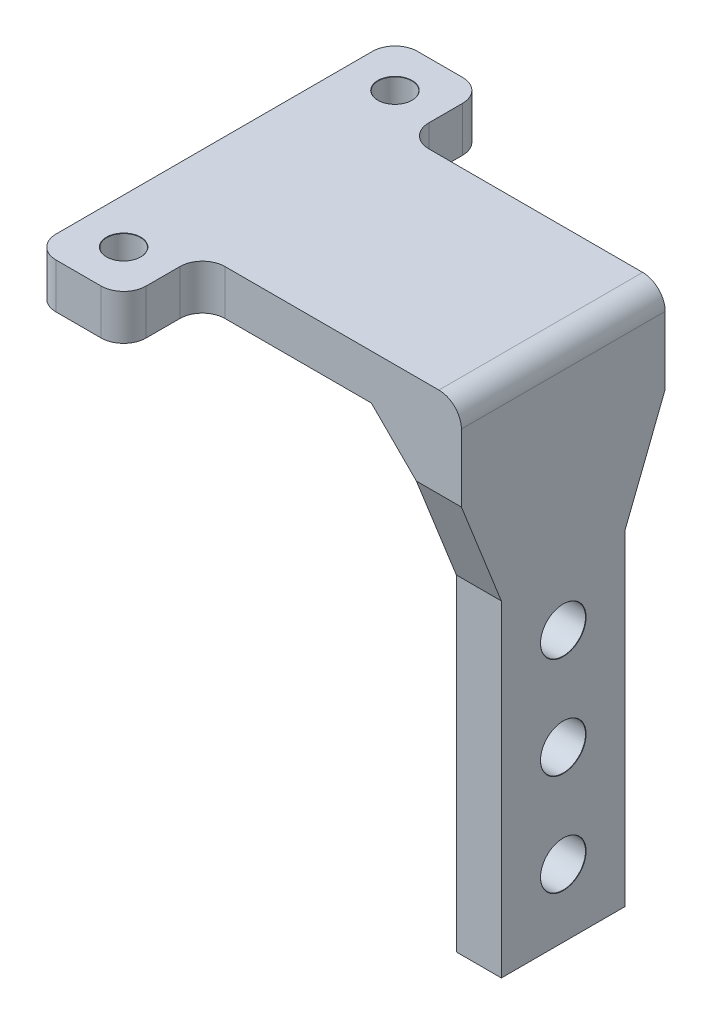
ISO-10303-21;
HEADER;
FILE_DESCRIPTION(('STEP AP214'),'2;1');
FILE_NAME('part.step','',(''),(''),'','','');
FILE_SCHEMA(('AUTOMOTIVE_DESIGN { 1 0 10303 214 1 1 1 1 }'));
ENDSEC;
DATA;
#1=APPLICATION_CONTEXT('core data for automotive mechanical design processes');
#2=APPLICATION_PROTOCOL_DEFINITION('international standard','automotive_design',2000,#1);
#3=PRODUCT_CONTEXT('',#1,'mechanical');
#4=PRODUCT('Part','Part','',(#3));
#5=PRODUCT_RELATED_PRODUCT_CATEGORY('part','',(#4));
#6=PRODUCT_DEFINITION_FORMATION('','',#4);
#7=PRODUCT_DEFINITION_CONTEXT('part definition',#1,'design');
#8=PRODUCT_DEFINITION('design','',#6,#7);
#9=PRODUCT_DEFINITION_SHAPE('','',#8);
#10=(LENGTH_UNIT() NAMED_UNIT(*) SI_UNIT(.MILLI.,.METRE.));
#11=(NAMED_UNIT(*) PLANE_ANGLE_UNIT() SI_UNIT($,.RADIAN.));
#12=(NAMED_UNIT(*) SI_UNIT($,.STERADIAN.) SOLID_ANGLE_UNIT());
#13=UNCERTAINTY_MEASURE_WITH_UNIT(LENGTH_MEASURE(1.E-05),#10,'distance_accuracy_value','');
#14=(GEOMETRIC_REPRESENTATION_CONTEXT(3) GLOBAL_UNCERTAINTY_ASSIGNED_CONTEXT((#13)) GLOBAL_UNIT_ASSIGNED_CONTEXT((#10,
#11,#12)) REPRESENTATION_CONTEXT('',''));
#15=CARTESIAN_POINT('',(0.,0.,0.));
#16=DIRECTION('',(0.,0.,1.));
#17=DIRECTION('',(1.,0.,0.));
#18=AXIS2_PLACEMENT_3D('',#15,#16,#17);
#19=CARTESIAN_POINT('',(0.,0.,0.));
#20=DIRECTION('',(0.,1.,0.));
#21=DIRECTION('',(0.,0.,1.));
#22=AXIS2_PLACEMENT_3D('',#19,#20,#21);
#23=PLANE('',#22);
#24=CARTESIAN_POINT('',(4.,0.,12.05));
#25=DIRECTION('',(0.,1.,0.));
#26=DIRECTION('',(0.,0.,1.));
#27=AXIS2_PLACEMENT_3D('',#24,#25,#26);
#28=CIRCLE('',#27,1.5);
#29=CARTESIAN_POINT('',(4.,0.,13.55));
#30=VERTEX_POINT('',#29);
#31=EDGE_CURVE('E340',#30,#30,#28,.T.);
#32=ORIENTED_EDGE('',*,*,#31,.T.);
#33=EDGE_LOOP('',(#32));
#34=FACE_BOUND('',#33,.T.);
#35=CARTESIAN_POINT('',(4.,0.,-12.05));
#36=DIRECTION('',(0.,1.,0.));
#37=DIRECTION('',(0.,0.,1.));
#38=AXIS2_PLACEMENT_3D('',#35,#36,#37);
#39=CIRCLE('',#38,1.5);
#40=CARTESIAN_POINT('',(4.,0.,-10.55));
#41=VERTEX_POINT('',#40);
#42=EDGE_CURVE('E331',#41,#41,#39,.T.);
#43=ORIENTED_EDGE('',*,*,#42,.T.);
#44=EDGE_LOOP('',(#43));
#45=FACE_BOUND('',#44,.T.);
#46=DIRECTION('',(-1.,0.,0.));
#47=VECTOR('',#46,1.);
#48=CARTESIAN_POINT('',(31.,0.,-9.05));
#49=LINE('',#48,#47);
#50=CARTESIAN_POINT('',(23.,0.,-9.05));
#51=VERTEX_POINT('',#50);
#52=CARTESIAN_POINT('',(10.,0.,-9.05));
#53=VERTEX_POINT('',#52);
#54=EDGE_CURVE('E377',#51,#53,#49,.T.);
#55=ORIENTED_EDGE('',*,*,#54,.F.);
#56=DIRECTION('',(0.,0.,1.));
#57=VECTOR('',#56,1.);
#58=CARTESIAN_POINT('',(23.,0.,9.05));
#59=LINE('',#58,#57);
#60=CARTESIAN_POINT('',(23.,0.,9.05));
#61=VERTEX_POINT('',#60);
#62=EDGE_CURVE('E276',#51,#61,#59,.T.);
#63=ORIENTED_EDGE('',*,*,#62,.T.);
#64=DIRECTION('',(1.,0.,0.));
#65=VECTOR('',#64,1.);
#66=CARTESIAN_POINT('',(8.,0.,9.05));
#67=LINE('',#66,#65);
#68=CARTESIAN_POINT('',(10.,0.,9.05));
#69=VERTEX_POINT('',#68);
#70=EDGE_CURVE('E375',#69,#61,#67,.T.);
#71=ORIENTED_EDGE('',*,*,#70,.F.);
#72=CARTESIAN_POINT('',(10.,0.,11.05));
#73=DIRECTION('',(0.,1.,0.));
#74=DIRECTION('',(0.,0.,1.));
#75=AXIS2_PLACEMENT_3D('',#72,#73,#74);
#76=CIRCLE('',#75,2.);
#77=CARTESIAN_POINT('',(8.,0.,11.05));
#78=VERTEX_POINT('',#77);
#79=EDGE_CURVE('E269',#69,#78,#76,.T.);
#80=ORIENTED_EDGE('',*,*,#79,.T.);
#81=DIRECTION('',(0.,0.,-1.));
#82=VECTOR('',#81,1.);
#83=CARTESIAN_POINT('',(8.,0.,16.05));
#84=LINE('',#83,#82);
#85=CARTESIAN_POINT('',(8.,0.,14.05));
#86=VERTEX_POINT('',#85);
#87=EDGE_CURVE('E372',#86,#78,#84,.T.);
#88=ORIENTED_EDGE('',*,*,#87,.F.);
#89=CARTESIAN_POINT('',(6.,0.,14.05));
#90=DIRECTION('',(0.,1.,0.));
#91=DIRECTION('',(0.,0.,1.));
#92=AXIS2_PLACEMENT_3D('',#89,#90,#91);
#93=CIRCLE('',#92,2.);
#94=CARTESIAN_POINT('',(6.,0.,16.05));
#95=VERTEX_POINT('',#94);
#96=EDGE_CURVE('E222',#86,#95,#93,.F.);
#97=ORIENTED_EDGE('',*,*,#96,.T.);
#98=DIRECTION('',(1.,0.,0.));
#99=VECTOR('',#98,1.);
#100=CARTESIAN_POINT('',(0.,0.,16.05));
#101=LINE('',#100,#99);
#102=CARTESIAN_POINT('',(2.,0.,16.05));
#103=VERTEX_POINT('',#102);
#104=EDGE_CURVE('E369',#103,#95,#101,.T.);
#105=ORIENTED_EDGE('',*,*,#104,.F.);
#106=CARTESIAN_POINT('',(2.,0.,14.05));
#107=DIRECTION('',(0.,1.,0.));
#108=DIRECTION('',(0.,0.,1.));
#109=AXIS2_PLACEMENT_3D('',#106,#107,#108);
#110=CIRCLE('',#109,2.);
#111=CARTESIAN_POINT('',(0.,0.,14.05));
#112=VERTEX_POINT('',#111);
#113=EDGE_CURVE('E224',#103,#112,#110,.F.);
#114=ORIENTED_EDGE('',*,*,#113,.T.);
#115=DIRECTION('',(0.,0.,1.));
#116=VECTOR('',#115,1.);
#117=CARTESIAN_POINT('',(0.,0.,-16.05));
#118=LINE('',#117,#116);
#119=CARTESIAN_POINT('',(0.,0.,-14.05));
#120=VERTEX_POINT('',#119);
#121=EDGE_CURVE('E366',#120,#112,#118,.T.);
#122=ORIENTED_EDGE('',*,*,#121,.F.);
#123=CARTESIAN_POINT('',(2.,0.,-14.05));
#124=DIRECTION('',(0.,1.,0.));
#125=DIRECTION('',(0.,0.,1.));
#126=AXIS2_PLACEMENT_3D('',#123,#124,#125);
#127=CIRCLE('',#126,2.);
#128=CARTESIAN_POINT('',(2.,0.,-16.05));
#129=VERTEX_POINT('',#128);
#130=EDGE_CURVE('E228',#120,#129,#127,.F.);
#131=ORIENTED_EDGE('',*,*,#130,.T.);
#132=DIRECTION('',(-1.,0.,0.));
#133=VECTOR('',#132,1.);
#134=CARTESIAN_POINT('',(8.,0.,-16.05));
#135=LINE('',#134,#133);
#136=CARTESIAN_POINT('',(6.,0.,-16.05));
#137=VERTEX_POINT('',#136);
#138=EDGE_CURVE('E343',#137,#129,#135,.T.);
#139=ORIENTED_EDGE('',*,*,#138,.F.);
#140=CARTESIAN_POINT('',(6.,0.,-14.05));
#141=DIRECTION('',(0.,1.,0.));
#142=DIRECTION('',(0.,0.,1.));
#143=AXIS2_PLACEMENT_3D('',#140,#141,#142);
#144=CIRCLE('',#143,2.);
#145=CARTESIAN_POINT('',(8.,0.,-14.05));
#146=VERTEX_POINT('',#145);
#147=EDGE_CURVE('E226',#137,#146,#144,.F.);
#148=ORIENTED_EDGE('',*,*,#147,.T.);
#149=DIRECTION('',(0.,0.,-1.));
#150=VECTOR('',#149,1.);
#151=CARTESIAN_POINT('',(8.,0.,-9.05));
#152=LINE('',#151,#150);
#153=CARTESIAN_POINT('',(8.,0.,-11.05));
#154=VERTEX_POINT('',#153);
#155=EDGE_CURVE('E348',#154,#146,#152,.T.);
#156=ORIENTED_EDGE('',*,*,#155,.F.);
#157=CARTESIAN_POINT('',(10.,0.,-11.05));
#158=DIRECTION('',(0.,1.,0.));
#159=DIRECTION('',(0.,0.,1.));
#160=AXIS2_PLACEMENT_3D('',#157,#158,#159);
#161=CIRCLE('',#160,2.);
#162=EDGE_CURVE('E264',#154,#53,#161,.T.);
#163=ORIENTED_EDGE('',*,*,#162,.T.);
#164=EDGE_LOOP('',(#55,#63,#71,#80,#88,#97,#105,#114,#122,#131,#139,#148,#156,#163));
#165=FACE_BOUND('',#164,.T.);
#166=ADVANCED_FACE('F39',(#34,#45,#165),#23,.F.);
#167=CARTESIAN_POINT('',(8.,4.,-16.05));
#168=DIRECTION('',(0.,0.,1.));
#169=DIRECTION('',(1.,0.,0.));
#170=AXIS2_PLACEMENT_3D('',#167,#168,#169);
#171=PLANE('',#170);
#172=ORIENTED_EDGE('',*,*,#138,.T.);
#173=DIRECTION('',(0.,-1.,0.));
#174=VECTOR('',#173,1.);
#175=CARTESIAN_POINT('',(2.,4.,-16.05));
#176=LINE('',#175,#174);
#177=CARTESIAN_POINT('',(2.,4.,-16.05));
#178=VERTEX_POINT('',#177);
#179=EDGE_CURVE('E233',#129,#178,#176,.F.);
#180=ORIENTED_EDGE('',*,*,#179,.T.);
#181=DIRECTION('',(-1.,0.,0.));
#182=VECTOR('',#181,1.);
#183=CARTESIAN_POINT('',(8.,4.,-16.05));
#184=LINE('',#183,#182);
#185=CARTESIAN_POINT('',(6.,4.,-16.05));
#186=VERTEX_POINT('',#185);
#187=EDGE_CURVE('E344',#186,#178,#184,.T.);
#188=ORIENTED_EDGE('',*,*,#187,.F.);
#189=DIRECTION('',(0.,-1.,0.));
#190=VECTOR('',#189,1.);
#191=CARTESIAN_POINT('',(6.,4.,-16.05));
#192=LINE('',#191,#190);
#193=EDGE_CURVE('E230',#186,#137,#192,.T.);
#194=ORIENTED_EDGE('',*,*,#193,.T.);
#195=EDGE_LOOP('',(#172,#180,#188,#194));
#196=FACE_BOUND('',#195,.T.);
#197=ADVANCED_FACE('F395',(#196),#171,.F.);
#198=CARTESIAN_POINT('',(0.,4.,-16.05));
#199=DIRECTION('',(1.,0.,0.));
#200=DIRECTION('',(0.,0.,-1.));
#201=AXIS2_PLACEMENT_3D('',#198,#199,#200);
#202=PLANE('',#201);
#203=DIRECTION('',(0.,0.,1.));
#204=VECTOR('',#203,1.);
#205=CARTESIAN_POINT('',(0.,4.,-16.05));
#206=LINE('',#205,#204);
#207=CARTESIAN_POINT('',(0.,4.,-14.05));
#208=VERTEX_POINT('',#207);
#209=CARTESIAN_POINT('',(0.,4.,14.05));
#210=VERTEX_POINT('',#209);
#211=EDGE_CURVE('E347',#208,#210,#206,.T.);
#212=ORIENTED_EDGE('',*,*,#211,.F.);
#213=DIRECTION('',(0.,-1.,0.));
#214=VECTOR('',#213,1.);
#215=CARTESIAN_POINT('',(0.,4.,-14.05));
#216=LINE('',#215,#214);
#217=EDGE_CURVE('E213',#208,#120,#216,.T.);
#218=ORIENTED_EDGE('',*,*,#217,.T.);
#219=ORIENTED_EDGE('',*,*,#121,.T.);
#220=DIRECTION('',(0.,-1.,0.));
#221=VECTOR('',#220,1.);
#222=CARTESIAN_POINT('',(0.,4.,14.05));
#223=LINE('',#222,#221);
#224=EDGE_CURVE('E210',#112,#210,#223,.F.);
#225=ORIENTED_EDGE('',*,*,#224,.T.);
#226=EDGE_LOOP('',(#212,#218,#219,#225));
#227=FACE_BOUND('',#226,.T.);
#228=ADVANCED_FACE('F404',(#227),#202,.F.);
#229=CARTESIAN_POINT('',(0.,4.,16.05));
#230=DIRECTION('',(0.,0.,-1.));
#231=DIRECTION('',(-1.,0.,0.));
#232=AXIS2_PLACEMENT_3D('',#229,#230,#231);
#233=PLANE('',#232);
#234=DIRECTION('',(1.,0.,0.));
#235=VECTOR('',#234,1.);
#236=CARTESIAN_POINT('',(0.,4.,16.05));
#237=LINE('',#236,#235);
#238=CARTESIAN_POINT('',(2.,4.,16.05));
#239=VERTEX_POINT('',#238);
#240=CARTESIAN_POINT('',(6.,4.,16.05));
#241=VERTEX_POINT('',#240);
#242=EDGE_CURVE('E351',#239,#241,#237,.T.);
#243=ORIENTED_EDGE('',*,*,#242,.F.);
#244=DIRECTION('',(0.,-1.,0.));
#245=VECTOR('',#244,1.);
#246=CARTESIAN_POINT('',(2.,4.,16.05));
#247=LINE('',#246,#245);
#248=EDGE_CURVE('E253',#239,#103,#247,.T.);
#249=ORIENTED_EDGE('',*,*,#248,.T.);
#250=ORIENTED_EDGE('',*,*,#104,.T.);
#251=DIRECTION('',(0.,-1.,0.));
#252=VECTOR('',#251,1.);
#253=CARTESIAN_POINT('',(6.,4.,16.05));
#254=LINE('',#253,#252);
#255=EDGE_CURVE('E251',#95,#241,#254,.F.);
#256=ORIENTED_EDGE('',*,*,#255,.T.);
#257=EDGE_LOOP('',(#243,#249,#250,#256));
#258=FACE_BOUND('',#257,.T.);
#259=ADVANCED_FACE('F413',(#258),#233,.F.);
#260=CARTESIAN_POINT('',(8.,4.,16.05));
#261=DIRECTION('',(-1.,0.,0.));
#262=DIRECTION('',(0.,0.,1.));
#263=AXIS2_PLACEMENT_3D('',#260,#261,#262);
#264=PLANE('',#263);
#265=DIRECTION('',(0.,0.,-1.));
#266=VECTOR('',#265,1.);
#267=CARTESIAN_POINT('',(8.,4.,16.05));
#268=LINE('',#267,#266);
#269=CARTESIAN_POINT('',(8.,4.,14.05));
#270=VERTEX_POINT('',#269);
#271=CARTESIAN_POINT('',(8.,4.,11.05));
#272=VERTEX_POINT('',#271);
#273=EDGE_CURVE('E354',#270,#272,#268,.T.);
#274=ORIENTED_EDGE('',*,*,#273,.F.);
#275=DIRECTION('',(0.,-1.,0.));
#276=VECTOR('',#275,1.);
#277=CARTESIAN_POINT('',(8.,4.,14.05));
#278=LINE('',#277,#276);
#279=EDGE_CURVE('E258',#270,#86,#278,.T.);
#280=ORIENTED_EDGE('',*,*,#279,.T.);
#281=ORIENTED_EDGE('',*,*,#87,.T.);
#282=DIRECTION('',(0.,-1.,0.));
#283=VECTOR('',#282,1.);
#284=CARTESIAN_POINT('',(8.,4.,11.05));
#285=LINE('',#284,#283);
#286=EDGE_CURVE('E256',#78,#272,#285,.F.);
#287=ORIENTED_EDGE('',*,*,#286,.T.);
#288=EDGE_LOOP('',(#274,#280,#281,#287));
#289=FACE_BOUND('',#288,.T.);
#290=ADVANCED_FACE('F422',(#289),#264,.F.);
#291=CARTESIAN_POINT('',(8.,4.,9.05));
#292=DIRECTION('',(0.,0.,-1.));
#293=DIRECTION('',(-1.,0.,0.));
#294=AXIS2_PLACEMENT_3D('',#291,#292,#293);
#295=PLANE('',#294);
#296=DIRECTION('',(-0.707106781186544,0.707106781186551,0.));
#297=VECTOR('',#296,1.);
#298=CARTESIAN_POINT('',(13.5000000000001,9.50000000000002,9.05));
#299=LINE('',#298,#297);
#300=CARTESIAN_POINT('',(27.,-4.00000000000005,9.05));
#301=VERTEX_POINT('',#300);
#302=EDGE_CURVE('E203',#61,#301,#299,.F.);
#303=ORIENTED_EDGE('',*,*,#302,.T.);
#304=DIRECTION('',(-1.,0.,0.));
#305=VECTOR('',#304,1.);
#306=CARTESIAN_POINT('',(31.,-4.00000000000005,9.05));
#307=LINE('',#306,#305);
#308=CARTESIAN_POINT('',(31.,-4.00000000000005,9.05));
#309=VERTEX_POINT('',#308);
#310=EDGE_CURVE('E186',#309,#301,#307,.T.);
#311=ORIENTED_EDGE('',*,*,#310,.F.);
#312=DIRECTION('',(0.,-1.,0.));
#313=VECTOR('',#312,1.);
#314=CARTESIAN_POINT('',(31.,4.,9.05));
#315=LINE('',#314,#313);
#316=CARTESIAN_POINT('',(31.,2.,9.05));
#317=VERTEX_POINT('',#316);
#318=EDGE_CURVE('E199',#317,#309,#315,.T.);
#319=ORIENTED_EDGE('',*,*,#318,.F.);
#320=CARTESIAN_POINT('',(29.,2.,9.05));
#321=DIRECTION('',(0.,0.,-1.));
#322=DIRECTION('',(-1.,0.,0.));
#323=AXIS2_PLACEMENT_3D('',#320,#321,#322);
#324=CIRCLE('',#323,2.);
#325=CARTESIAN_POINT('',(29.,4.,9.05));
#326=VERTEX_POINT('',#325);
#327=EDGE_CURVE('E47',#317,#326,#324,.F.);
#328=ORIENTED_EDGE('',*,*,#327,.T.);
#329=DIRECTION('',(1.,0.,0.));
#330=VECTOR('',#329,1.);
#331=CARTESIAN_POINT('',(8.,4.,9.05));
#332=LINE('',#331,#330);
#333=CARTESIAN_POINT('',(10.,4.,9.05));
#334=VERTEX_POINT('',#333);
#335=EDGE_CURVE('E357',#334,#326,#332,.T.);
#336=ORIENTED_EDGE('',*,*,#335,.F.);
#337=DIRECTION('',(0.,-1.,0.));
#338=VECTOR('',#337,1.);
#339=CARTESIAN_POINT('',(10.,0.,9.05));
#340=LINE('',#339,#338);
#341=EDGE_CURVE('E261',#334,#69,#340,.T.);
#342=ORIENTED_EDGE('',*,*,#341,.T.);
#343=ORIENTED_EDGE('',*,*,#70,.T.);
#344=EDGE_LOOP('',(#303,#311,#319,#328,#336,#342,#343));
#345=FACE_BOUND('',#344,.T.);
#346=ADVANCED_FACE('F198',(#345),#295,.F.);
#347=CARTESIAN_POINT('',(31.,4.,9.05));
#348=DIRECTION('',(-1.,0.,0.));
#349=DIRECTION('',(0.,0.,1.));
#350=AXIS2_PLACEMENT_3D('',#347,#348,#349);
#351=PLANE('',#350);
#352=CARTESIAN_POINT('',(31.,-36.,0.));
#353=DIRECTION('',(1.,0.,0.));
#354=DIRECTION('',(0.,0.,-1.));
#355=AXIS2_PLACEMENT_3D('',#352,#353,#354);
#356=CIRCLE('',#355,2.025);
#357=CARTESIAN_POINT('',(31.,-36.,-2.025));
#358=VERTEX_POINT('',#357);
#359=EDGE_CURVE('E306',#358,#358,#356,.T.);
#360=ORIENTED_EDGE('',*,*,#359,.F.);
#361=EDGE_LOOP('',(#360));
#362=FACE_BOUND('',#361,.T.);
#363=CARTESIAN_POINT('',(31.,-27.,0.));
#364=DIRECTION('',(1.,0.,0.));
#365=DIRECTION('',(0.,0.,-1.));
#366=AXIS2_PLACEMENT_3D('',#363,#364,#365);
#367=CIRCLE('',#366,2.025);
#368=CARTESIAN_POINT('',(31.,-27.,-2.025));
#369=VERTEX_POINT('',#368);
#370=EDGE_CURVE('E299',#369,#369,#367,.T.);
#371=ORIENTED_EDGE('',*,*,#370,.F.);
#372=EDGE_LOOP('',(#371));
#373=FACE_BOUND('',#372,.T.);
#374=CARTESIAN_POINT('',(31.,-18.,0.));
#375=DIRECTION('',(1.,0.,0.));
#376=DIRECTION('',(0.,0.,-1.));
#377=AXIS2_PLACEMENT_3D('',#374,#375,#376);
#378=CIRCLE('',#377,2.025);
#379=CARTESIAN_POINT('',(31.,-18.,-2.025));
#380=VERTEX_POINT('',#379);
#381=EDGE_CURVE('E295',#380,#380,#378,.T.);
#382=ORIENTED_EDGE('',*,*,#381,.F.);
#383=EDGE_LOOP('',(#382));
#384=FACE_BOUND('',#383,.T.);
#385=DIRECTION('',(0.,-0.930248086317103,-0.366931189602858));
#386=VECTOR('',#385,1.);
#387=CARTESIAN_POINT('',(31.,-4.00000000000005,9.05));
#388=LINE('',#387,#386);
#389=CARTESIAN_POINT('',(31.,-13.,5.5));
#390=VERTEX_POINT('',#389);
#391=EDGE_CURVE('E182',#309,#390,#388,.T.);
#392=ORIENTED_EDGE('',*,*,#391,.T.);
#393=DIRECTION('',(0.,-1.,0.));
#394=VECTOR('',#393,1.);
#395=CARTESIAN_POINT('',(31.,-13.,5.5));
#396=LINE('',#395,#394);
#397=CARTESIAN_POINT('',(31.,-42.,5.5));
#398=VERTEX_POINT('',#397);
#399=EDGE_CURVE('E193',#390,#398,#396,.T.);
#400=ORIENTED_EDGE('',*,*,#399,.T.);
#401=DIRECTION('',(0.,0.,1.));
#402=VECTOR('',#401,1.);
#403=CARTESIAN_POINT('',(31.,-42.,9.05));
#404=LINE('',#403,#402);
#405=CARTESIAN_POINT('',(31.,-42.,-5.50000000000002));
#406=VERTEX_POINT('',#405);
#407=EDGE_CURVE('E291',#406,#398,#404,.T.);
#408=ORIENTED_EDGE('',*,*,#407,.F.);
#409=DIRECTION('',(0.,1.,0.));
#410=VECTOR('',#409,1.);
#411=CARTESIAN_POINT('',(31.,-13.,-5.50000000000002));
#412=LINE('',#411,#410);
#413=CARTESIAN_POINT('',(31.,-13.,-5.50000000000002));
#414=VERTEX_POINT('',#413);
#415=EDGE_CURVE('E62',#406,#414,#412,.T.);
#416=ORIENTED_EDGE('',*,*,#415,.T.);
#417=DIRECTION('',(0.,0.930248086317103,-0.366931189602856));
#418=VECTOR('',#417,1.);
#419=CARTESIAN_POINT('',(31.,-4.00000000000005,-9.05));
#420=LINE('',#419,#418);
#421=CARTESIAN_POINT('',(31.,-4.00000000000005,-9.05));
#422=VERTEX_POINT('',#421);
#423=EDGE_CURVE('E457',#414,#422,#420,.T.);
#424=ORIENTED_EDGE('',*,*,#423,.T.);
#425=DIRECTION('',(0.,-1.,0.));
#426=VECTOR('',#425,1.);
#427=CARTESIAN_POINT('',(31.,4.,-9.05));
#428=LINE('',#427,#426);
#429=CARTESIAN_POINT('',(31.,2.,-9.05));
#430=VERTEX_POINT('',#429);
#431=EDGE_CURVE('E211',#430,#422,#428,.T.);
#432=ORIENTED_EDGE('',*,*,#431,.F.);
#433=DIRECTION('',(0.,0.,-1.));
#434=VECTOR('',#433,1.);
#435=CARTESIAN_POINT('',(31.,2.,9.05));
#436=LINE('',#435,#434);
#437=EDGE_CURVE('E209',#430,#317,#436,.F.);
#438=ORIENTED_EDGE('',*,*,#437,.T.);
#439=ORIENTED_EDGE('',*,*,#318,.T.);
#440=EDGE_LOOP('',(#392,#400,#408,#416,#424,#432,#438,#439));
#441=FACE_BOUND('',#440,.T.);
#442=ADVANCED_FACE('F206',(#362,#373,#384,#441),#351,.F.);
#443=CARTESIAN_POINT('',(31.,4.,-9.05));
#444=DIRECTION('',(0.,0.,1.));
#445=DIRECTION('',(1.,0.,0.));
#446=AXIS2_PLACEMENT_3D('',#443,#444,#445);
#447=PLANE('',#446);
#448=ORIENTED_EDGE('',*,*,#431,.T.);
#449=DIRECTION('',(-1.,0.,0.));
#450=VECTOR('',#449,1.);
#451=CARTESIAN_POINT('',(31.,-4.00000000000005,-9.05));
#452=LINE('',#451,#450);
#453=CARTESIAN_POINT('',(27.,-4.00000000000005,-9.05));
#454=VERTEX_POINT('',#453);
#455=EDGE_CURVE('E461',#422,#454,#452,.T.);
#456=ORIENTED_EDGE('',*,*,#455,.T.);
#457=DIRECTION('',(0.707106781186544,-0.707106781186551,0.));
#458=VECTOR('',#457,1.);
#459=CARTESIAN_POINT('',(25.,-1.99999999999998,-9.05));
#460=LINE('',#459,#458);
#461=EDGE_CURVE('E278',#454,#51,#460,.F.);
#462=ORIENTED_EDGE('',*,*,#461,.T.);
#463=ORIENTED_EDGE('',*,*,#54,.T.);
#464=DIRECTION('',(0.,-1.,0.));
#465=VECTOR('',#464,1.);
#466=CARTESIAN_POINT('',(10.,4.,-9.05));
#467=LINE('',#466,#465);
#468=CARTESIAN_POINT('',(10.,4.,-9.05));
#469=VERTEX_POINT('',#468);
#470=EDGE_CURVE('E248',#53,#469,#467,.F.);
#471=ORIENTED_EDGE('',*,*,#470,.T.);
#472=DIRECTION('',(-1.,0.,0.));
#473=VECTOR('',#472,1.);
#474=CARTESIAN_POINT('',(31.,4.,-9.05));
#475=LINE('',#474,#473);
#476=CARTESIAN_POINT('',(29.,4.,-9.05));
#477=VERTEX_POINT('',#476);
#478=EDGE_CURVE('E360',#477,#469,#475,.T.);
#479=ORIENTED_EDGE('',*,*,#478,.F.);
#480=CARTESIAN_POINT('',(29.,2.,-9.05));
#481=DIRECTION('',(0.,0.,1.));
#482=DIRECTION('',(1.,0.,0.));
#483=AXIS2_PLACEMENT_3D('',#480,#481,#482);
#484=CIRCLE('',#483,2.);
#485=EDGE_CURVE('E284',#477,#430,#484,.F.);
#486=ORIENTED_EDGE('',*,*,#485,.T.);
#487=EDGE_LOOP('',(#448,#456,#462,#463,#471,#479,#486));
#488=FACE_BOUND('',#487,.T.);
#489=ADVANCED_FACE('F434',(#488),#447,.F.);
#490=CARTESIAN_POINT('',(8.,4.,-9.05));
#491=DIRECTION('',(-1.,0.,0.));
#492=DIRECTION('',(0.,0.,1.));
#493=AXIS2_PLACEMENT_3D('',#490,#491,#492);
#494=PLANE('',#493);
#495=DIRECTION('',(0.,0.,-1.));
#496=VECTOR('',#495,1.);
#497=CARTESIAN_POINT('',(8.,4.,-9.05));
#498=LINE('',#497,#496);
#499=CARTESIAN_POINT('',(8.,4.,-11.05));
#500=VERTEX_POINT('',#499);
#501=CARTESIAN_POINT('',(8.,4.,-14.05));
#502=VERTEX_POINT('',#501);
#503=EDGE_CURVE('E216',#500,#502,#498,.T.);
#504=ORIENTED_EDGE('',*,*,#503,.F.);
#505=DIRECTION('',(0.,-1.,0.));
#506=VECTOR('',#505,1.);
#507=CARTESIAN_POINT('',(8.,0.,-11.05));
#508=LINE('',#507,#506);
#509=EDGE_CURVE('E245',#500,#154,#508,.T.);
#510=ORIENTED_EDGE('',*,*,#509,.T.);
#511=ORIENTED_EDGE('',*,*,#155,.T.);
#512=DIRECTION('',(0.,-1.,0.));
#513=VECTOR('',#512,1.);
#514=CARTESIAN_POINT('',(8.,4.,-14.05));
#515=LINE('',#514,#513);
#516=EDGE_CURVE('E243',#146,#502,#515,.F.);
#517=ORIENTED_EDGE('',*,*,#516,.T.);
#518=EDGE_LOOP('',(#504,#510,#511,#517));
#519=FACE_BOUND('',#518,.T.);
#520=ADVANCED_FACE('F383',(#519),#494,.F.);
#521=CARTESIAN_POINT('',(0.,4.,0.));
#522=DIRECTION('',(0.,1.,0.));
#523=DIRECTION('',(0.,0.,1.));
#524=AXIS2_PLACEMENT_3D('',#521,#522,#523);
#525=PLANE('',#524);
#526=CARTESIAN_POINT('',(4.,4.,-12.05));
#527=DIRECTION('',(0.,1.,0.));
#528=DIRECTION('',(0.,0.,1.));
#529=AXIS2_PLACEMENT_3D('',#526,#527,#528);
#530=CIRCLE('',#529,1.525);
#531=CARTESIAN_POINT('',(4.,4.,-10.525));
#532=VERTEX_POINT('',#531);
#533=EDGE_CURVE('E325',#532,#532,#530,.T.);
#534=ORIENTED_EDGE('',*,*,#533,.F.);
#535=EDGE_LOOP('',(#534));
#536=FACE_BOUND('',#535,.T.);
#537=CARTESIAN_POINT('',(4.,4.,12.05));
#538=DIRECTION('',(0.,1.,0.));
#539=DIRECTION('',(0.,0.,1.));
#540=AXIS2_PLACEMENT_3D('',#537,#538,#539);
#541=CIRCLE('',#540,1.525);
#542=CARTESIAN_POINT('',(4.,4.,13.575));
#543=VERTEX_POINT('',#542);
#544=EDGE_CURVE('E334',#543,#543,#541,.T.);
#545=ORIENTED_EDGE('',*,*,#544,.F.);
#546=EDGE_LOOP('',(#545));
#547=FACE_BOUND('',#546,.T.);
#548=ORIENTED_EDGE('',*,*,#335,.T.);
#549=DIRECTION('',(0.,0.,-1.));
#550=VECTOR('',#549,1.);
#551=CARTESIAN_POINT('',(29.,4.,-9.05));
#552=LINE('',#551,#550);
#553=EDGE_CURVE('E281',#326,#477,#552,.T.);
#554=ORIENTED_EDGE('',*,*,#553,.T.);
#555=ORIENTED_EDGE('',*,*,#478,.T.);
#556=CARTESIAN_POINT('',(10.,4.,-11.05));
#557=DIRECTION('',(0.,1.,0.));
#558=DIRECTION('',(0.,0.,1.));
#559=AXIS2_PLACEMENT_3D('',#556,#557,#558);
#560=CIRCLE('',#559,2.);
#561=EDGE_CURVE('E267',#469,#500,#560,.F.);
#562=ORIENTED_EDGE('',*,*,#561,.T.);
#563=ORIENTED_EDGE('',*,*,#503,.T.);
#564=CARTESIAN_POINT('',(6.,4.,-14.05));
#565=DIRECTION('',(0.,1.,0.));
#566=DIRECTION('',(0.,0.,1.));
#567=AXIS2_PLACEMENT_3D('',#564,#565,#566);
#568=CIRCLE('',#567,2.);
#569=EDGE_CURVE('E239',#502,#186,#568,.T.);
#570=ORIENTED_EDGE('',*,*,#569,.T.);
#571=ORIENTED_EDGE('',*,*,#187,.T.);
#572=CARTESIAN_POINT('',(2.,4.,-14.05));
#573=DIRECTION('',(0.,1.,0.));
#574=DIRECTION('',(0.,0.,1.));
#575=AXIS2_PLACEMENT_3D('',#572,#573,#574);
#576=CIRCLE('',#575,2.);
#577=EDGE_CURVE('E241',#178,#208,#576,.T.);
#578=ORIENTED_EDGE('',*,*,#577,.T.);
#579=ORIENTED_EDGE('',*,*,#211,.T.);
#580=CARTESIAN_POINT('',(2.,4.,14.05));
#581=DIRECTION('',(0.,1.,0.));
#582=DIRECTION('',(0.,0.,1.));
#583=AXIS2_PLACEMENT_3D('',#580,#581,#582);
#584=CIRCLE('',#583,2.);
#585=EDGE_CURVE('E237',#210,#239,#584,.T.);
#586=ORIENTED_EDGE('',*,*,#585,.T.);
#587=ORIENTED_EDGE('',*,*,#242,.T.);
#588=CARTESIAN_POINT('',(6.,4.,14.05));
#589=DIRECTION('',(0.,1.,0.));
#590=DIRECTION('',(0.,0.,1.));
#591=AXIS2_PLACEMENT_3D('',#588,#589,#590);
#592=CIRCLE('',#591,2.);
#593=EDGE_CURVE('E235',#241,#270,#592,.T.);
#594=ORIENTED_EDGE('',*,*,#593,.T.);
#595=ORIENTED_EDGE('',*,*,#273,.T.);
#596=CARTESIAN_POINT('',(10.,4.,11.05));
#597=DIRECTION('',(0.,1.,0.));
#598=DIRECTION('',(0.,0.,1.));
#599=AXIS2_PLACEMENT_3D('',#596,#597,#598);
#600=CIRCLE('',#599,2.);
#601=EDGE_CURVE('E271',#272,#334,#600,.F.);
#602=ORIENTED_EDGE('',*,*,#601,.T.);
#603=EDGE_LOOP('',(#548,#554,#555,#562,#563,#570,#571,#578,#579,#586,#587,#594,#595,#602));
#604=FACE_BOUND('',#603,.T.);
#605=ADVANCED_FACE('F392',(#536,#547,#604),#525,.T.);
#606=CARTESIAN_POINT('',(2.,4.,-14.05));
#607=DIRECTION('',(0.,-1.,0.));
#608=DIRECTION('',(0.,0.,-1.));
#609=AXIS2_PLACEMENT_3D('',#606,#607,#608);
#610=CYLINDRICAL_SURFACE('',#609,2.);
#611=ORIENTED_EDGE('',*,*,#577,.F.);
#612=ORIENTED_EDGE('',*,*,#179,.F.);
#613=ORIENTED_EDGE('',*,*,#130,.F.);
#614=ORIENTED_EDGE('',*,*,#217,.F.);
#615=EDGE_LOOP('',(#611,#612,#613,#614));
#616=FACE_BOUND('',#615,.T.);
#617=ADVANCED_FACE('F399',(#616),#610,.T.);
#618=CARTESIAN_POINT('',(10.,4.,-11.05));
#619=DIRECTION('',(0.,1.,0.));
#620=DIRECTION('',(0.,0.,1.));
#621=AXIS2_PLACEMENT_3D('',#618,#619,#620);
#622=CYLINDRICAL_SURFACE('',#621,2.);
#623=ORIENTED_EDGE('',*,*,#561,.F.);
#624=ORIENTED_EDGE('',*,*,#470,.F.);
#625=ORIENTED_EDGE('',*,*,#162,.F.);
#626=ORIENTED_EDGE('',*,*,#509,.F.);
#627=EDGE_LOOP('',(#623,#624,#625,#626));
#628=FACE_BOUND('',#627,.T.);
#629=ADVANCED_FACE('F439',(#628),#622,.F.);
#630=CARTESIAN_POINT('',(6.,4.,-14.05));
#631=DIRECTION('',(0.,-1.,0.));
#632=DIRECTION('',(0.,0.,-1.));
#633=AXIS2_PLACEMENT_3D('',#630,#631,#632);
#634=CYLINDRICAL_SURFACE('',#633,2.);
#635=ORIENTED_EDGE('',*,*,#569,.F.);
#636=ORIENTED_EDGE('',*,*,#516,.F.);
#637=ORIENTED_EDGE('',*,*,#147,.F.);
#638=ORIENTED_EDGE('',*,*,#193,.F.);
#639=EDGE_LOOP('',(#635,#636,#637,#638));
#640=FACE_BOUND('',#639,.T.);
#641=ADVANCED_FACE('F388',(#640),#634,.T.);
#642=CARTESIAN_POINT('',(2.,4.,14.05));
#643=DIRECTION('',(0.,-1.,0.));
#644=DIRECTION('',(0.,0.,-1.));
#645=AXIS2_PLACEMENT_3D('',#642,#643,#644);
#646=CYLINDRICAL_SURFACE('',#645,2.);
#647=ORIENTED_EDGE('',*,*,#585,.F.);
#648=ORIENTED_EDGE('',*,*,#224,.F.);
#649=ORIENTED_EDGE('',*,*,#113,.F.);
#650=ORIENTED_EDGE('',*,*,#248,.F.);
#651=EDGE_LOOP('',(#647,#648,#649,#650));
#652=FACE_BOUND('',#651,.T.);
#653=ADVANCED_FACE('F408',(#652),#646,.T.);
#654=CARTESIAN_POINT('',(6.,4.,14.05));
#655=DIRECTION('',(0.,-1.,0.));
#656=DIRECTION('',(0.,0.,-1.));
#657=AXIS2_PLACEMENT_3D('',#654,#655,#656);
#658=CYLINDRICAL_SURFACE('',#657,2.);
#659=ORIENTED_EDGE('',*,*,#593,.F.);
#660=ORIENTED_EDGE('',*,*,#255,.F.);
#661=ORIENTED_EDGE('',*,*,#96,.F.);
#662=ORIENTED_EDGE('',*,*,#279,.F.);
#663=EDGE_LOOP('',(#659,#660,#661,#662));
#664=FACE_BOUND('',#663,.T.);
#665=ADVANCED_FACE('F417',(#664),#658,.T.);
#666=CARTESIAN_POINT('',(10.,4.,11.05));
#667=DIRECTION('',(0.,1.,0.));
#668=DIRECTION('',(0.,0.,1.));
#669=AXIS2_PLACEMENT_3D('',#666,#667,#668);
#670=CYLINDRICAL_SURFACE('',#669,2.);
#671=ORIENTED_EDGE('',*,*,#601,.F.);
#672=ORIENTED_EDGE('',*,*,#286,.F.);
#673=ORIENTED_EDGE('',*,*,#79,.F.);
#674=ORIENTED_EDGE('',*,*,#341,.F.);
#675=EDGE_LOOP('',(#671,#672,#673,#674));
#676=FACE_BOUND('',#675,.T.);
#677=ADVANCED_FACE('F426',(#676),#670,.F.);
#678=CARTESIAN_POINT('',(4.,4.,12.05));
#679=DIRECTION('',(0.,1.,0.));
#680=DIRECTION('',(0.,0.,1.));
#681=AXIS2_PLACEMENT_3D('',#678,#679,#680);
#682=CYLINDRICAL_SURFACE('',#681,1.5);
#683=ORIENTED_EDGE('',*,*,#31,.F.);
#684=EDGE_LOOP('',(#683));
#685=FACE_BOUND('',#684,.T.);
#686=CARTESIAN_POINT('',(4.,3.975,12.05));
#687=DIRECTION('',(0.,1.,0.));
#688=DIRECTION('',(0.,0.,1.));
#689=AXIS2_PLACEMENT_3D('',#686,#687,#688);
#690=CIRCLE('',#689,1.5);
#691=CARTESIAN_POINT('',(4.,3.975,13.55));
#692=VERTEX_POINT('',#691);
#693=EDGE_CURVE('E337',#692,#692,#690,.T.);
#694=ORIENTED_EDGE('',*,*,#693,.T.);
#695=EDGE_LOOP('',(#694));
#696=FACE_BOUND('',#695,.T.);
#697=ADVANCED_FACE('F520',(#685,#696),#682,.F.);
#698=CARTESIAN_POINT('',(4.,4.,12.05));
#699=DIRECTION('',(0.,1.,0.));
#700=DIRECTION('',(0.,0.,1.));
#701=AXIS2_PLACEMENT_3D('',#698,#699,#700);
#702=CONICAL_SURFACE('',#701,1.525,0.785398163397466);
#703=ORIENTED_EDGE('',*,*,#693,.F.);
#704=EDGE_LOOP('',(#703));
#705=FACE_BOUND('',#704,.T.);
#706=ORIENTED_EDGE('',*,*,#544,.T.);
#707=EDGE_LOOP('',(#706));
#708=FACE_BOUND('',#707,.T.);
#709=ADVANCED_FACE('F545',(#705,#708),#702,.F.);
#710=CARTESIAN_POINT('',(4.,4.,-12.05));
#711=DIRECTION('',(0.,1.,0.));
#712=DIRECTION('',(0.,0.,1.));
#713=AXIS2_PLACEMENT_3D('',#710,#711,#712);
#714=CYLINDRICAL_SURFACE('',#713,1.5);
#715=ORIENTED_EDGE('',*,*,#42,.F.);
#716=EDGE_LOOP('',(#715));
#717=FACE_BOUND('',#716,.T.);
#718=CARTESIAN_POINT('',(4.,3.975,-12.05));
#719=DIRECTION('',(0.,1.,0.));
#720=DIRECTION('',(0.,0.,1.));
#721=AXIS2_PLACEMENT_3D('',#718,#719,#720);
#722=CIRCLE('',#721,1.5);
#723=CARTESIAN_POINT('',(4.,3.975,-10.55));
#724=VERTEX_POINT('',#723);
#725=EDGE_CURVE('E328',#724,#724,#722,.T.);
#726=ORIENTED_EDGE('',*,*,#725,.T.);
#727=EDGE_LOOP('',(#726));
#728=FACE_BOUND('',#727,.T.);
#729=ADVANCED_FACE('F541',(#717,#728),#714,.F.);
#730=CARTESIAN_POINT('',(4.,4.,-12.05));
#731=DIRECTION('',(0.,1.,0.));
#732=DIRECTION('',(0.,0.,1.));
#733=AXIS2_PLACEMENT_3D('',#730,#731,#732);
#734=CONICAL_SURFACE('',#733,1.525,0.785398163397466);
#735=ORIENTED_EDGE('',*,*,#725,.F.);
#736=EDGE_LOOP('',(#735));
#737=FACE_BOUND('',#736,.T.);
#738=ORIENTED_EDGE('',*,*,#533,.T.);
#739=EDGE_LOOP('',(#738));
#740=FACE_BOUND('',#739,.T.);
#741=ADVANCED_FACE('F534',(#737,#740),#734,.F.);
#742=CARTESIAN_POINT('',(27.,-42.,9.05));
#743=DIRECTION('',(1.,0.,0.));
#744=DIRECTION('',(0.,0.,-1.));
#745=AXIS2_PLACEMENT_3D('',#742,#743,#744);
#746=PLANE('',#745);
#747=CARTESIAN_POINT('',(27.,-36.,0.));
#748=DIRECTION('',(1.,0.,0.));
#749=DIRECTION('',(0.,0.,-1.));
#750=AXIS2_PLACEMENT_3D('',#747,#748,#749);
#751=CIRCLE('',#750,1.99999999999999);
#752=CARTESIAN_POINT('',(27.,-36.,-2.));
#753=VERTEX_POINT('',#752);
#754=EDGE_CURVE('E297',#753,#753,#751,.T.);
#755=ORIENTED_EDGE('',*,*,#754,.T.);
#756=EDGE_LOOP('',(#755));
#757=FACE_BOUND('',#756,.T.);
#758=CARTESIAN_POINT('',(27.,-27.,0.));
#759=DIRECTION('',(1.,0.,0.));
#760=DIRECTION('',(0.,0.,-1.));
#761=AXIS2_PLACEMENT_3D('',#758,#759,#760);
#762=CIRCLE('',#761,1.99999999999999);
#763=CARTESIAN_POINT('',(27.,-27.,-2.));
#764=VERTEX_POINT('',#763);
#765=EDGE_CURVE('E293',#764,#764,#762,.T.);
#766=ORIENTED_EDGE('',*,*,#765,.T.);
#767=EDGE_LOOP('',(#766));
#768=FACE_BOUND('',#767,.T.);
#769=CARTESIAN_POINT('',(27.,-18.,0.));
#770=DIRECTION('',(1.,0.,0.));
#771=DIRECTION('',(0.,0.,-1.));
#772=AXIS2_PLACEMENT_3D('',#769,#770,#771);
#773=CIRCLE('',#772,1.99999999999999);
#774=CARTESIAN_POINT('',(27.,-18.,-2.));
#775=VERTEX_POINT('',#774);
#776=EDGE_CURVE('E288',#775,#775,#773,.T.);
#777=ORIENTED_EDGE('',*,*,#776,.T.);
#778=EDGE_LOOP('',(#777));
#779=FACE_BOUND('',#778,.T.);
#780=DIRECTION('',(0.,0.,-1.));
#781=VECTOR('',#780,1.);
#782=CARTESIAN_POINT('',(27.,-42.,9.05));
#783=LINE('',#782,#781);
#784=CARTESIAN_POINT('',(27.,-42.,5.5));
#785=VERTEX_POINT('',#784);
#786=CARTESIAN_POINT('',(27.,-42.,-5.50000000000002));
#787=VERTEX_POINT('',#786);
#788=EDGE_CURVE('E323',#785,#787,#783,.T.);
#789=ORIENTED_EDGE('',*,*,#788,.F.);
#790=DIRECTION('',(0.,-1.,0.));
#791=VECTOR('',#790,1.);
#792=CARTESIAN_POINT('',(27.,-13.,5.5));
#793=LINE('',#792,#791);
#794=CARTESIAN_POINT('',(27.,-13.,5.5));
#795=VERTEX_POINT('',#794);
#796=EDGE_CURVE('E54',#795,#785,#793,.T.);
#797=ORIENTED_EDGE('',*,*,#796,.F.);
#798=DIRECTION('',(0.,-0.930248086317103,-0.366931189602858));
#799=VECTOR('',#798,1.);
#800=CARTESIAN_POINT('',(27.,-4.00000000000005,9.05));
#801=LINE('',#800,#799);
#802=EDGE_CURVE('E448',#301,#795,#801,.T.);
#803=ORIENTED_EDGE('',*,*,#802,.F.);
#804=DIRECTION('',(0.,0.,-1.));
#805=VECTOR('',#804,1.);
#806=CARTESIAN_POINT('',(27.,-4.00000000000003,-9.05));
#807=LINE('',#806,#805);
#808=EDGE_CURVE('E273',#301,#454,#807,.T.);
#809=ORIENTED_EDGE('',*,*,#808,.T.);
#810=DIRECTION('',(0.,-0.930248086317104,0.366931189602856));
#811=VECTOR('',#810,1.);
#812=CARTESIAN_POINT('',(27.,-43.0619374482519,6.35776421569928));
#813=LINE('',#812,#811);
#814=CARTESIAN_POINT('',(27.,-13.,-5.50000000000002));
#815=VERTEX_POINT('',#814);
#816=EDGE_CURVE('E11',#454,#815,#813,.T.);
#817=ORIENTED_EDGE('',*,*,#816,.T.);
#818=DIRECTION('',(0.,-1.,0.));
#819=VECTOR('',#818,1.);
#820=CARTESIAN_POINT('',(27.,-42.,-5.50000000000002));
#821=LINE('',#820,#819);
#822=EDGE_CURVE('E311',#815,#787,#821,.T.);
#823=ORIENTED_EDGE('',*,*,#822,.T.);
#824=EDGE_LOOP('',(#789,#797,#803,#809,#817,#823));
#825=FACE_BOUND('',#824,.T.);
#826=ADVANCED_FACE('F446',(#757,#768,#779,#825),#746,.F.);
#827=CARTESIAN_POINT('',(0.,-42.,0.));
#828=DIRECTION('',(0.,1.,0.));
#829=DIRECTION('',(0.,0.,1.));
#830=AXIS2_PLACEMENT_3D('',#827,#828,#829);
#831=PLANE('',#830);
#832=ORIENTED_EDGE('',*,*,#407,.T.);
#833=DIRECTION('',(-1.,0.,0.));
#834=VECTOR('',#833,1.);
#835=CARTESIAN_POINT('',(31.,-42.,5.5));
#836=LINE('',#835,#834);
#837=EDGE_CURVE('E453',#398,#785,#836,.T.);
#838=ORIENTED_EDGE('',*,*,#837,.T.);
#839=ORIENTED_EDGE('',*,*,#788,.T.);
#840=DIRECTION('',(-1.,0.,0.));
#841=VECTOR('',#840,1.);
#842=CARTESIAN_POINT('',(31.,-42.,-5.50000000000002));
#843=LINE('',#842,#841);
#844=EDGE_CURVE('E460',#406,#787,#843,.T.);
#845=ORIENTED_EDGE('',*,*,#844,.F.);
#846=EDGE_LOOP('',(#832,#838,#839,#845));
#847=FACE_BOUND('',#846,.T.);
#848=ADVANCED_FACE('F473',(#847),#831,.F.);
#849=CARTESIAN_POINT('',(27.,-4.00000000000003,9.05));
#850=DIRECTION('',(-0.707106781186551,-0.707106781186544,0.));
#851=DIRECTION('',(0.,0.,1.));
#852=AXIS2_PLACEMENT_3D('',#849,#850,#851);
#853=PLANE('',#852);
#854=ORIENTED_EDGE('',*,*,#302,.F.);
#855=ORIENTED_EDGE('',*,*,#62,.F.);
#856=ORIENTED_EDGE('',*,*,#461,.F.);
#857=ORIENTED_EDGE('',*,*,#808,.F.);
#858=EDGE_LOOP('',(#854,#855,#856,#857));
#859=FACE_BOUND('',#858,.T.);
#860=ADVANCED_FACE('F443',(#859),#853,.T.);
#861=CARTESIAN_POINT('',(29.,2.,0.));
#862=DIRECTION('',(0.,0.,1.));
#863=DIRECTION('',(1.,0.,0.));
#864=AXIS2_PLACEMENT_3D('',#861,#862,#863);
#865=CYLINDRICAL_SURFACE('',#864,2.);
#866=ORIENTED_EDGE('',*,*,#327,.F.);
#867=ORIENTED_EDGE('',*,*,#437,.F.);
#868=ORIENTED_EDGE('',*,*,#485,.F.);
#869=ORIENTED_EDGE('',*,*,#553,.F.);
#870=EDGE_LOOP('',(#866,#867,#868,#869));
#871=FACE_BOUND('',#870,.T.);
#872=ADVANCED_FACE('F41',(#871),#865,.T.);
#873=CARTESIAN_POINT('',(31.,-18.,0.));
#874=DIRECTION('',(1.,0.,0.));
#875=DIRECTION('',(0.,0.,-1.));
#876=AXIS2_PLACEMENT_3D('',#873,#874,#875);
#877=CYLINDRICAL_SURFACE('',#876,1.99999999999999);
#878=CARTESIAN_POINT('',(30.975,-18.,0.));
#879=DIRECTION('',(1.,0.,0.));
#880=DIRECTION('',(0.,0.,-1.));
#881=AXIS2_PLACEMENT_3D('',#878,#879,#880);
#882=CIRCLE('',#881,1.99999999999999);
#883=CARTESIAN_POINT('',(30.975,-18.,-2.));
#884=VERTEX_POINT('',#883);
#885=EDGE_CURVE('E292',#884,#884,#882,.T.);
#886=ORIENTED_EDGE('',*,*,#885,.T.);
#887=EDGE_LOOP('',(#886));
#888=FACE_BOUND('',#887,.T.);
#889=ORIENTED_EDGE('',*,*,#776,.F.);
#890=EDGE_LOOP('',(#889));
#891=FACE_BOUND('',#890,.T.);
#892=ADVANCED_FACE('F529',(#888,#891),#877,.F.);
#893=CARTESIAN_POINT('',(31.,-18.,0.));
#894=DIRECTION('',(1.,0.,0.));
#895=DIRECTION('',(0.,0.,-1.));
#896=AXIS2_PLACEMENT_3D('',#893,#894,#895);
#897=CONICAL_SURFACE('',#896,2.025,0.785398163397518);
#898=ORIENTED_EDGE('',*,*,#885,.F.);
#899=EDGE_LOOP('',(#898));
#900=FACE_BOUND('',#899,.T.);
#901=ORIENTED_EDGE('',*,*,#381,.T.);
#902=EDGE_LOOP('',(#901));
#903=FACE_BOUND('',#902,.T.);
#904=ADVANCED_FACE('F658',(#900,#903),#897,.F.);
#905=CARTESIAN_POINT('',(31.,-27.,0.));
#906=DIRECTION('',(1.,0.,0.));
#907=DIRECTION('',(0.,0.,-1.));
#908=AXIS2_PLACEMENT_3D('',#905,#906,#907);
#909=CYLINDRICAL_SURFACE('',#908,1.99999999999999);
#910=CARTESIAN_POINT('',(30.975,-27.,0.));
#911=DIRECTION('',(1.,0.,0.));
#912=DIRECTION('',(0.,0.,-1.));
#913=AXIS2_PLACEMENT_3D('',#910,#911,#912);
#914=CIRCLE('',#913,1.99999999999999);
#915=CARTESIAN_POINT('',(30.975,-27.,-2.));
#916=VERTEX_POINT('',#915);
#917=EDGE_CURVE('E296',#916,#916,#914,.T.);
#918=ORIENTED_EDGE('',*,*,#917,.T.);
#919=EDGE_LOOP('',(#918));
#920=FACE_BOUND('',#919,.T.);
#921=ORIENTED_EDGE('',*,*,#765,.F.);
#922=EDGE_LOOP('',(#921));
#923=FACE_BOUND('',#922,.T.);
#924=ADVANCED_FACE('F667',(#920,#923),#909,.F.);
#925=CARTESIAN_POINT('',(31.,-27.,0.));
#926=DIRECTION('',(1.,0.,0.));
#927=DIRECTION('',(0.,0.,-1.));
#928=AXIS2_PLACEMENT_3D('',#925,#926,#927);
#929=CONICAL_SURFACE('',#928,2.025,0.785398163397518);
#930=ORIENTED_EDGE('',*,*,#917,.F.);
#931=EDGE_LOOP('',(#930));
#932=FACE_BOUND('',#931,.T.);
#933=ORIENTED_EDGE('',*,*,#370,.T.);
#934=EDGE_LOOP('',(#933));
#935=FACE_BOUND('',#934,.T.);
#936=ADVANCED_FACE('F676',(#932,#935),#929,.F.);
#937=CARTESIAN_POINT('',(31.,-36.,0.));
#938=DIRECTION('',(1.,0.,0.));
#939=DIRECTION('',(0.,0.,-1.));
#940=AXIS2_PLACEMENT_3D('',#937,#938,#939);
#941=CYLINDRICAL_SURFACE('',#940,1.99999999999999);
#942=CARTESIAN_POINT('',(30.975,-36.,0.));
#943=DIRECTION('',(1.,0.,0.));
#944=DIRECTION('',(0.,0.,-1.));
#945=AXIS2_PLACEMENT_3D('',#942,#943,#944);
#946=CIRCLE('',#945,1.99999999999999);
#947=CARTESIAN_POINT('',(30.975,-36.,-2.));
#948=VERTEX_POINT('',#947);
#949=EDGE_CURVE('E300',#948,#948,#946,.T.);
#950=ORIENTED_EDGE('',*,*,#949,.T.);
#951=EDGE_LOOP('',(#950));
#952=FACE_BOUND('',#951,.T.);
#953=ORIENTED_EDGE('',*,*,#754,.F.);
#954=EDGE_LOOP('',(#953));
#955=FACE_BOUND('',#954,.T.);
#956=ADVANCED_FACE('F686',(#952,#955),#941,.F.);
#957=CARTESIAN_POINT('',(31.,-36.,0.));
#958=DIRECTION('',(1.,0.,0.));
#959=DIRECTION('',(0.,0.,-1.));
#960=AXIS2_PLACEMENT_3D('',#957,#958,#959);
#961=CONICAL_SURFACE('',#960,2.025,0.785398163397518);
#962=ORIENTED_EDGE('',*,*,#949,.F.);
#963=EDGE_LOOP('',(#962));
#964=FACE_BOUND('',#963,.T.);
#965=ORIENTED_EDGE('',*,*,#359,.T.);
#966=EDGE_LOOP('',(#965));
#967=FACE_BOUND('',#966,.T.);
#968=ADVANCED_FACE('F696',(#964,#967),#961,.F.);
#969=CARTESIAN_POINT('',(31.,-4.00000000000005,-9.05));
#970=DIRECTION('',(0.,0.366931189602856,0.930248086317103));
#971=DIRECTION('',(0.,-0.930248086317104,0.366931189602856));
#972=AXIS2_PLACEMENT_3D('',#969,#970,#971);
#973=PLANE('',#972);
#974=ORIENTED_EDGE('',*,*,#455,.F.);
#975=ORIENTED_EDGE('',*,*,#423,.F.);
#976=DIRECTION('',(-1.,0.,0.));
#977=VECTOR('',#976,1.);
#978=CARTESIAN_POINT('',(31.,-13.,-5.50000000000002));
#979=LINE('',#978,#977);
#980=EDGE_CURVE('E464',#414,#815,#979,.T.);
#981=ORIENTED_EDGE('',*,*,#980,.T.);
#982=ORIENTED_EDGE('',*,*,#816,.F.);
#983=EDGE_LOOP('',(#974,#975,#981,#982));
#984=FACE_BOUND('',#983,.T.);
#985=ADVANCED_FACE('F470',(#984),#973,.F.);
#986=CARTESIAN_POINT('',(31.,-13.,-5.50000000000002));
#987=DIRECTION('',(0.,0.,1.));
#988=DIRECTION('',(1.,0.,0.));
#989=AXIS2_PLACEMENT_3D('',#986,#987,#988);
#990=PLANE('',#989);
#991=ORIENTED_EDGE('',*,*,#980,.F.);
#992=ORIENTED_EDGE('',*,*,#415,.F.);
#993=ORIENTED_EDGE('',*,*,#844,.T.);
#994=ORIENTED_EDGE('',*,*,#822,.F.);
#995=EDGE_LOOP('',(#991,#992,#993,#994));
#996=FACE_BOUND('',#995,.T.);
#997=ADVANCED_FACE('F467',(#996),#990,.F.);
#998=CARTESIAN_POINT('',(31.,-13.,5.5));
#999=DIRECTION('',(0.,0.,-1.));
#1000=DIRECTION('',(0.,1.,0.));
#1001=AXIS2_PLACEMENT_3D('',#998,#999,#1000);
#1002=PLANE('',#1001);
#1003=ORIENTED_EDGE('',*,*,#796,.T.);
#1004=ORIENTED_EDGE('',*,*,#837,.F.);
#1005=ORIENTED_EDGE('',*,*,#399,.F.);
#1006=DIRECTION('',(-1.,0.,0.));
#1007=VECTOR('',#1006,1.);
#1008=CARTESIAN_POINT('',(31.,-13.,5.5));
#1009=LINE('',#1008,#1007);
#1010=EDGE_CURVE('E188',#390,#795,#1009,.T.);
#1011=ORIENTED_EDGE('',*,*,#1010,.T.);
#1012=EDGE_LOOP('',(#1003,#1004,#1005,#1011));
#1013=FACE_BOUND('',#1012,.T.);
#1014=ADVANCED_FACE('F474',(#1013),#1002,.F.);
#1015=CARTESIAN_POINT('',(31.,-4.00000000000005,9.05));
#1016=DIRECTION('',(0.,0.366931189602857,-0.930248086317103));
#1017=DIRECTION('',(0.,0.930248086317103,0.366931189602857));
#1018=AXIS2_PLACEMENT_3D('',#1015,#1016,#1017);
#1019=PLANE('',#1018);
#1020=ORIENTED_EDGE('',*,*,#802,.T.);
#1021=ORIENTED_EDGE('',*,*,#1010,.F.);
#1022=ORIENTED_EDGE('',*,*,#391,.F.);
#1023=ORIENTED_EDGE('',*,*,#310,.T.);
#1024=EDGE_LOOP('',(#1020,#1021,#1022,#1023));
#1025=FACE_BOUND('',#1024,.T.);
#1026=ADVANCED_FACE('F185',(#1025),#1019,.F.);
#1027=CLOSED_SHELL('',(#166,#197,#228,#259,#290,#346,#442,#489,#520,#605,#617,#629,#641,#653,
#665,#677,#697,#709,#729,#741,#826,#848,#860,#872,#892,#904,#924,#936,#956,#968,#985,#997,#1014,#1026));
#1028=MANIFOLD_SOLID_BREP('B2',#1027);
#1029=ADVANCED_BREP_SHAPE_REPRESENTATION('',(#18,#1028),#14);
#1030=SHAPE_DEFINITION_REPRESENTATION(#9,#1029);
ENDSEC;
END-ISO-10303-21;
